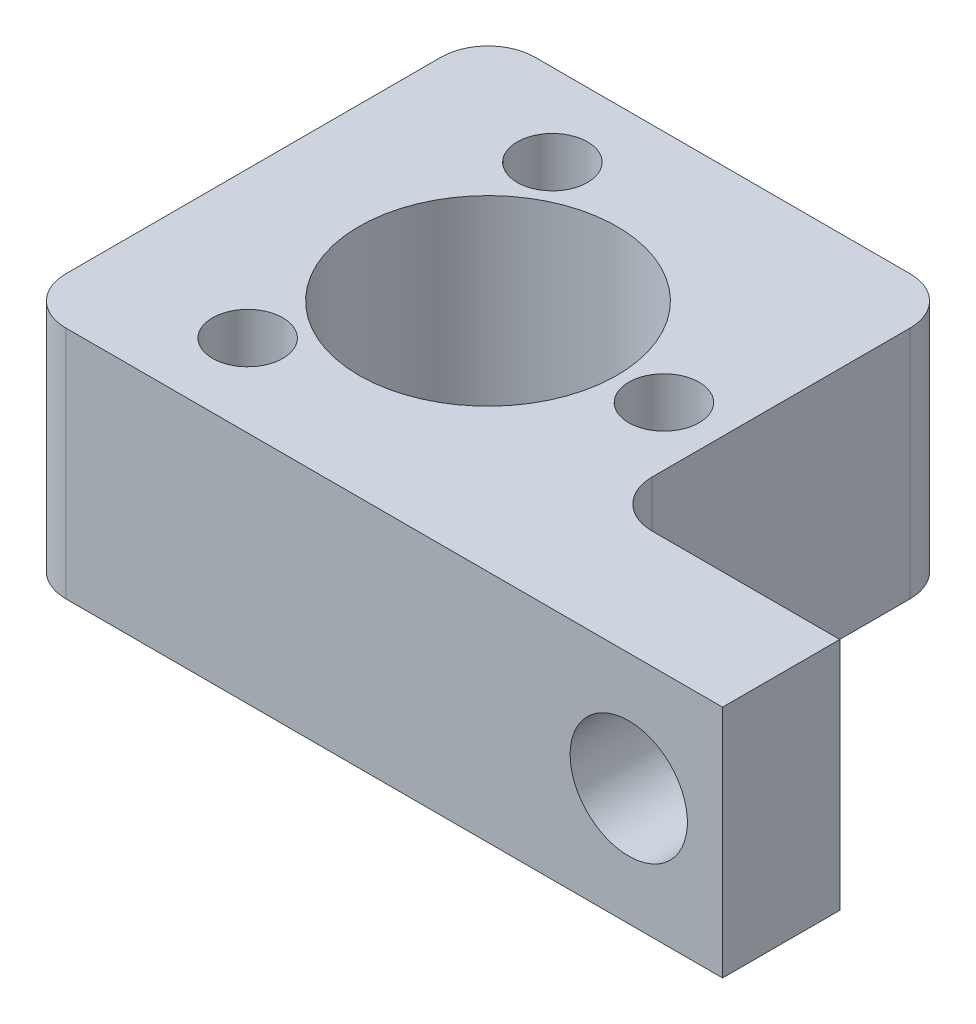
ISO-10303-21;
HEADER;
FILE_DESCRIPTION(('STEP AP214'),'2;1');
FILE_NAME('part.step','',(''),(''),'','','');
FILE_SCHEMA(('AUTOMOTIVE_DESIGN { 1 0 10303 214 1 1 1 1 }'));
ENDSEC;
DATA;
#1=APPLICATION_CONTEXT('core data for automotive mechanical design processes');
#2=APPLICATION_PROTOCOL_DEFINITION('international standard','automotive_design',2000,#1);
#3=PRODUCT_CONTEXT('',#1,'mechanical');
#4=PRODUCT('Part','Part','',(#3));
#5=PRODUCT_RELATED_PRODUCT_CATEGORY('part','',(#4));
#6=PRODUCT_DEFINITION_FORMATION('','',#4);
#7=PRODUCT_DEFINITION_CONTEXT('part definition',#1,'design');
#8=PRODUCT_DEFINITION('design','',#6,#7);
#9=PRODUCT_DEFINITION_SHAPE('','',#8);
#10=(LENGTH_UNIT() NAMED_UNIT(*) SI_UNIT(.MILLI.,.METRE.));
#11=(NAMED_UNIT(*) PLANE_ANGLE_UNIT() SI_UNIT($,.RADIAN.));
#12=(NAMED_UNIT(*) SI_UNIT($,.STERADIAN.) SOLID_ANGLE_UNIT());
#13=UNCERTAINTY_MEASURE_WITH_UNIT(LENGTH_MEASURE(1.E-05),#10,'distance_accuracy_value','');
#14=(GEOMETRIC_REPRESENTATION_CONTEXT(3) GLOBAL_UNCERTAINTY_ASSIGNED_CONTEXT((#13)) GLOBAL_UNIT_ASSIGNED_CONTEXT((#10,
#11,#12)) REPRESENTATION_CONTEXT('',''));
#15=CARTESIAN_POINT('',(0.,0.,0.));
#16=DIRECTION('',(0.,0.,1.));
#17=DIRECTION('',(1.,0.,0.));
#18=AXIS2_PLACEMENT_3D('',#15,#16,#17);
#19=CARTESIAN_POINT('',(12.7,12.7,0.));
#20=DIRECTION('',(1.,0.,0.));
#21=DIRECTION('',(0.,0.,-1.));
#22=AXIS2_PLACEMENT_3D('',#19,#20,#21);
#23=PLANE('',#22);
#24=DIRECTION('',(0.,0.,1.));
#25=VECTOR('',#24,1.);
#26=CARTESIAN_POINT('',(12.7,0.,0.));
#27=LINE('',#26,#25);
#28=CARTESIAN_POINT('',(12.7,0.,-6.35));
#29=VERTEX_POINT('',#28);
#30=CARTESIAN_POINT('',(12.7,0.,0.));
#31=VERTEX_POINT('',#30);
#32=EDGE_CURVE('E234',#29,#31,#27,.T.);
#33=ORIENTED_EDGE('',*,*,#32,.F.);
#34=DIRECTION('',(0.,-1.,0.));
#35=VECTOR('',#34,1.);
#36=CARTESIAN_POINT('',(12.7,12.7,-6.35));
#37=LINE('',#36,#35);
#38=CARTESIAN_POINT('',(12.7,12.7,-6.35));
#39=VERTEX_POINT('',#38);
#40=EDGE_CURVE('E220',#39,#29,#37,.T.);
#41=ORIENTED_EDGE('',*,*,#40,.F.);
#42=DIRECTION('',(0.,0.,1.));
#43=VECTOR('',#42,1.);
#44=CARTESIAN_POINT('',(12.7,12.7,0.));
#45=LINE('',#44,#43);
#46=CARTESIAN_POINT('',(12.7,12.7,0.));
#47=VERTEX_POINT('',#46);
#48=EDGE_CURVE('E228',#39,#47,#45,.T.);
#49=ORIENTED_EDGE('',*,*,#48,.T.);
#50=DIRECTION('',(0.,-1.,0.));
#51=VECTOR('',#50,1.);
#52=CARTESIAN_POINT('',(12.7,12.7,0.));
#53=LINE('',#52,#51);
#54=EDGE_CURVE('E237',#47,#31,#53,.T.);
#55=ORIENTED_EDGE('',*,*,#54,.T.);
#56=EDGE_LOOP('',(#33,#41,#49,#55));
#57=FACE_BOUND('',#56,.T.);
#58=ADVANCED_FACE('F137',(#57),#23,.T.);
#59=CARTESIAN_POINT('',(0.,12.7,-6.35));
#60=DIRECTION('',(0.,0.,-1.));
#61=DIRECTION('',(-1.,0.,0.));
#62=AXIS2_PLACEMENT_3D('',#59,#60,#61);
#63=PLANE('',#62);
#64=CARTESIAN_POINT('',(7.62,6.35,-6.35));
#65=DIRECTION('',(0.,0.,-1.));
#66=DIRECTION('',(-1.,0.,0.));
#67=AXIS2_PLACEMENT_3D('',#64,#65,#66);
#68=CIRCLE('',#67,3.175);
#69=CARTESIAN_POINT('',(4.445,6.35,-6.35));
#70=VERTEX_POINT('',#69);
#71=EDGE_CURVE('E251',#70,#70,#68,.T.);
#72=ORIENTED_EDGE('',*,*,#71,.F.);
#73=EDGE_LOOP('',(#72));
#74=FACE_BOUND('',#73,.T.);
#75=DIRECTION('',(1.,0.,0.));
#76=VECTOR('',#75,1.);
#77=CARTESIAN_POINT('',(0.,0.,-6.35));
#78=LINE('',#77,#76);
#79=CARTESIAN_POINT('',(2.54,0.,-6.35));
#80=VERTEX_POINT('',#79);
#81=EDGE_CURVE('E248',#80,#29,#78,.T.);
#82=ORIENTED_EDGE('',*,*,#81,.F.);
#83=DIRECTION('',(0.,-1.,0.));
#84=VECTOR('',#83,1.);
#85=CARTESIAN_POINT('',(2.54,12.7,-6.35));
#86=LINE('',#85,#84);
#87=CARTESIAN_POINT('',(2.54,12.7,-6.35));
#88=VERTEX_POINT('',#87);
#89=EDGE_CURVE('E223',#80,#88,#86,.F.);
#90=ORIENTED_EDGE('',*,*,#89,.T.);
#91=DIRECTION('',(1.,0.,0.));
#92=VECTOR('',#91,1.);
#93=CARTESIAN_POINT('',(0.,12.7,-6.35));
#94=LINE('',#93,#92);
#95=EDGE_CURVE('E216',#88,#39,#94,.T.);
#96=ORIENTED_EDGE('',*,*,#95,.T.);
#97=ORIENTED_EDGE('',*,*,#40,.T.);
#98=EDGE_LOOP('',(#82,#90,#96,#97));
#99=FACE_BOUND('',#98,.T.);
#100=ADVANCED_FACE('F219',(#74,#99),#63,.T.);
#101=CARTESIAN_POINT('',(0.,12.7,0.));
#102=DIRECTION('',(0.,0.,-1.));
#103=DIRECTION('',(-1.,0.,0.));
#104=AXIS2_PLACEMENT_3D('',#101,#102,#103);
#105=PLANE('',#104);
#106=CARTESIAN_POINT('',(7.62,6.35,0.));
#107=DIRECTION('',(0.,0.,-1.));
#108=DIRECTION('',(-1.,0.,0.));
#109=AXIS2_PLACEMENT_3D('',#106,#107,#108);
#110=CIRCLE('',#109,3.175);
#111=CARTESIAN_POINT('',(4.445,6.35,0.));
#112=VERTEX_POINT('',#111);
#113=EDGE_CURVE('E272',#112,#112,#110,.T.);
#114=ORIENTED_EDGE('',*,*,#113,.T.);
#115=EDGE_LOOP('',(#114));
#116=FACE_BOUND('',#115,.T.);
#117=DIRECTION('',(1.,0.,0.));
#118=VECTOR('',#117,1.);
#119=CARTESIAN_POINT('',(0.,12.7,0.));
#120=LINE('',#119,#118);
#121=CARTESIAN_POINT('',(-22.86,12.7,0.));
#122=VERTEX_POINT('',#121);
#123=EDGE_CURVE('E227',#122,#47,#120,.T.);
#124=ORIENTED_EDGE('',*,*,#123,.F.);
#125=DIRECTION('',(0.,-1.,0.));
#126=VECTOR('',#125,1.);
#127=CARTESIAN_POINT('',(-22.86,0.,0.));
#128=LINE('',#127,#126);
#129=CARTESIAN_POINT('',(-22.86,0.,0.));
#130=VERTEX_POINT('',#129);
#131=EDGE_CURVE('E324',#122,#130,#128,.T.);
#132=ORIENTED_EDGE('',*,*,#131,.T.);
#133=DIRECTION('',(1.,0.,0.));
#134=VECTOR('',#133,1.);
#135=CARTESIAN_POINT('',(0.,0.,0.));
#136=LINE('',#135,#134);
#137=EDGE_CURVE('E245',#130,#31,#136,.T.);
#138=ORIENTED_EDGE('',*,*,#137,.T.);
#139=ORIENTED_EDGE('',*,*,#54,.F.);
#140=EDGE_LOOP('',(#124,#132,#138,#139));
#141=FACE_BOUND('',#140,.T.);
#142=ADVANCED_FACE('F387',(#116,#141),#105,.F.);
#143=CARTESIAN_POINT('',(0.,12.7,0.));
#144=DIRECTION('',(0.,1.,0.));
#145=DIRECTION('',(0.,0.,1.));
#146=AXIS2_PLACEMENT_3D('',#143,#144,#145);
#147=PLANE('',#146);
#148=DIRECTION('',(0.,0.,-1.));
#149=VECTOR('',#148,1.);
#150=CARTESIAN_POINT('',(-25.4,12.7,0.));
#151=LINE('',#150,#149);
#152=CARTESIAN_POINT('',(-25.4,12.7,-2.54));
#153=VERTEX_POINT('',#152);
#154=CARTESIAN_POINT('',(-25.4,12.7,-22.86));
#155=VERTEX_POINT('',#154);
#156=EDGE_CURVE('E297',#153,#155,#151,.T.);
#157=ORIENTED_EDGE('',*,*,#156,.F.);
#158=CARTESIAN_POINT('',(-22.86,12.7,-2.54));
#159=DIRECTION('',(0.,1.,0.));
#160=DIRECTION('',(0.,0.,1.));
#161=AXIS2_PLACEMENT_3D('',#158,#159,#160);
#162=CIRCLE('',#161,2.54);
#163=EDGE_CURVE('E349',#153,#122,#162,.T.);
#164=ORIENTED_EDGE('',*,*,#163,.T.);
#165=ORIENTED_EDGE('',*,*,#123,.T.);
#166=ORIENTED_EDGE('',*,*,#48,.F.);
#167=ORIENTED_EDGE('',*,*,#95,.F.);
#168=CARTESIAN_POINT('',(2.54,12.7,-8.89));
#169=DIRECTION('',(0.,1.,0.));
#170=DIRECTION('',(0.,0.,1.));
#171=AXIS2_PLACEMENT_3D('',#168,#169,#170);
#172=CIRCLE('',#171,2.54);
#173=CARTESIAN_POINT('',(0.,12.7,-8.89));
#174=VERTEX_POINT('',#173);
#175=EDGE_CURVE('E12',#88,#174,#172,.F.);
#176=ORIENTED_EDGE('',*,*,#175,.T.);
#177=DIRECTION('',(0.,0.,-1.));
#178=VECTOR('',#177,1.);
#179=CARTESIAN_POINT('',(0.,12.7,0.));
#180=LINE('',#179,#178);
#181=CARTESIAN_POINT('',(0.,12.7,-22.86));
#182=VERTEX_POINT('',#181);
#183=EDGE_CURVE('E258',#174,#182,#180,.T.);
#184=ORIENTED_EDGE('',*,*,#183,.T.);
#185=CARTESIAN_POINT('',(-2.54,12.7,-22.86));
#186=DIRECTION('',(0.,1.,0.));
#187=DIRECTION('',(0.,0.,1.));
#188=AXIS2_PLACEMENT_3D('',#185,#186,#187);
#189=CIRCLE('',#188,2.54);
#190=CARTESIAN_POINT('',(-2.54,12.7,-25.4));
#191=VERTEX_POINT('',#190);
#192=EDGE_CURVE('E160',#182,#191,#189,.T.);
#193=ORIENTED_EDGE('',*,*,#192,.T.);
#194=DIRECTION('',(-1.,0.,0.));
#195=VECTOR('',#194,1.);
#196=CARTESIAN_POINT('',(0.,12.7,-25.4));
#197=LINE('',#196,#195);
#198=CARTESIAN_POINT('',(-22.86,12.7,-25.4));
#199=VERTEX_POINT('',#198);
#200=EDGE_CURVE('E301',#191,#199,#197,.T.);
#201=ORIENTED_EDGE('',*,*,#200,.T.);
#202=CARTESIAN_POINT('',(-22.86,12.7,-22.86));
#203=DIRECTION('',(0.,1.,0.));
#204=DIRECTION('',(0.,0.,1.));
#205=AXIS2_PLACEMENT_3D('',#202,#203,#204);
#206=CIRCLE('',#205,2.54);
#207=EDGE_CURVE('E346',#199,#155,#206,.T.);
#208=ORIENTED_EDGE('',*,*,#207,.T.);
#209=EDGE_LOOP('',(#157,#164,#165,#166,#167,#176,#184,#193,#201,#208));
#210=FACE_BOUND('',#209,.T.);
#211=CARTESIAN_POINT('',(-12.7,12.7,-12.7));
#212=DIRECTION('',(0.,1.,0.));
#213=DIRECTION('',(0.,0.,1.));
#214=AXIS2_PLACEMENT_3D('',#211,#212,#213);
#215=CIRCLE('',#214,6.985);
#216=CARTESIAN_POINT('',(-12.7,12.7,-5.715));
#217=VERTEX_POINT('',#216);
#218=EDGE_CURVE('E289',#217,#217,#215,.T.);
#219=ORIENTED_EDGE('',*,*,#218,.F.);
#220=EDGE_LOOP('',(#219));
#221=FACE_BOUND('',#220,.T.);
#222=CARTESIAN_POINT('',(-3.175,12.7,-12.7));
#223=DIRECTION('',(0.,1.,0.));
#224=DIRECTION('',(0.,0.,1.));
#225=AXIS2_PLACEMENT_3D('',#222,#223,#224);
#226=CIRCLE('',#225,1.905);
#227=CARTESIAN_POINT('',(-3.175,12.7,-10.795));
#228=VERTEX_POINT('',#227);
#229=EDGE_CURVE('E281',#228,#228,#226,.T.);
#230=ORIENTED_EDGE('',*,*,#229,.F.);
#231=EDGE_LOOP('',(#230));
#232=FACE_BOUND('',#231,.T.);
#233=CARTESIAN_POINT('',(-17.4624999999999,12.7,-4.45110802895317));
#234=DIRECTION('',(0.,1.,0.));
#235=DIRECTION('',(0.,0.,1.));
#236=AXIS2_PLACEMENT_3D('',#233,#234,#235);
#237=CIRCLE('',#236,1.905);
#238=CARTESIAN_POINT('',(-17.4624999999999,12.7,-2.54610802895317));
#239=VERTEX_POINT('',#238);
#240=EDGE_CURVE('E273',#239,#239,#237,.T.);
#241=ORIENTED_EDGE('',*,*,#240,.F.);
#242=EDGE_LOOP('',(#241));
#243=FACE_BOUND('',#242,.T.);
#244=CARTESIAN_POINT('',(-17.4625,12.7,-20.9488919710468));
#245=DIRECTION('',(0.,1.,0.));
#246=DIRECTION('',(0.,0.,1.));
#247=AXIS2_PLACEMENT_3D('',#244,#245,#246);
#248=CIRCLE('',#247,1.905);
#249=CARTESIAN_POINT('',(-17.4625,12.7,-19.0438919710468));
#250=VERTEX_POINT('',#249);
#251=EDGE_CURVE('E263',#250,#250,#248,.T.);
#252=ORIENTED_EDGE('',*,*,#251,.F.);
#253=EDGE_LOOP('',(#252));
#254=FACE_BOUND('',#253,.T.);
#255=ADVANCED_FACE('F240',(#210,#221,#232,#243,#254),#147,.T.);
#256=CARTESIAN_POINT('',(0.,0.,0.));
#257=DIRECTION('',(0.,1.,0.));
#258=DIRECTION('',(0.,0.,1.));
#259=AXIS2_PLACEMENT_3D('',#256,#257,#258);
#260=PLANE('',#259);
#261=ORIENTED_EDGE('',*,*,#137,.F.);
#262=CARTESIAN_POINT('',(-22.86,0.,-2.54));
#263=DIRECTION('',(0.,1.,0.));
#264=DIRECTION('',(0.,0.,1.));
#265=AXIS2_PLACEMENT_3D('',#262,#263,#264);
#266=CIRCLE('',#265,2.54);
#267=CARTESIAN_POINT('',(-25.4,0.,-2.54));
#268=VERTEX_POINT('',#267);
#269=EDGE_CURVE('E334',#130,#268,#266,.F.);
#270=ORIENTED_EDGE('',*,*,#269,.T.);
#271=DIRECTION('',(0.,0.,-1.));
#272=VECTOR('',#271,1.);
#273=CARTESIAN_POINT('',(-25.4,0.,0.));
#274=LINE('',#273,#272);
#275=CARTESIAN_POINT('',(-25.4,0.,-22.86));
#276=VERTEX_POINT('',#275);
#277=EDGE_CURVE('E293',#268,#276,#274,.T.);
#278=ORIENTED_EDGE('',*,*,#277,.T.);
#279=CARTESIAN_POINT('',(-22.86,0.,-22.86));
#280=DIRECTION('',(0.,1.,0.));
#281=DIRECTION('',(0.,0.,1.));
#282=AXIS2_PLACEMENT_3D('',#279,#280,#281);
#283=CIRCLE('',#282,2.54);
#284=CARTESIAN_POINT('',(-22.86,0.,-25.4));
#285=VERTEX_POINT('',#284);
#286=EDGE_CURVE('E331',#276,#285,#283,.F.);
#287=ORIENTED_EDGE('',*,*,#286,.T.);
#288=DIRECTION('',(-1.,0.,0.));
#289=VECTOR('',#288,1.);
#290=CARTESIAN_POINT('',(0.,0.,-25.4));
#291=LINE('',#290,#289);
#292=CARTESIAN_POINT('',(-2.54,0.,-25.4));
#293=VERTEX_POINT('',#292);
#294=EDGE_CURVE('E310',#293,#285,#291,.T.);
#295=ORIENTED_EDGE('',*,*,#294,.F.);
#296=CARTESIAN_POINT('',(-2.54,0.,-22.86));
#297=DIRECTION('',(0.,1.,0.));
#298=DIRECTION('',(0.,0.,1.));
#299=AXIS2_PLACEMENT_3D('',#296,#297,#298);
#300=CIRCLE('',#299,2.54);
#301=CARTESIAN_POINT('',(0.,0.,-22.86));
#302=VERTEX_POINT('',#301);
#303=EDGE_CURVE('E328',#293,#302,#300,.F.);
#304=ORIENTED_EDGE('',*,*,#303,.T.);
#305=DIRECTION('',(0.,0.,-1.));
#306=VECTOR('',#305,1.);
#307=CARTESIAN_POINT('',(0.,0.,0.));
#308=LINE('',#307,#306);
#309=CARTESIAN_POINT('',(0.,0.,-8.89));
#310=VERTEX_POINT('',#309);
#311=EDGE_CURVE('E302',#310,#302,#308,.T.);
#312=ORIENTED_EDGE('',*,*,#311,.F.);
#313=CARTESIAN_POINT('',(2.54,0.,-8.89));
#314=DIRECTION('',(0.,1.,0.));
#315=DIRECTION('',(0.,0.,1.));
#316=AXIS2_PLACEMENT_3D('',#313,#314,#315);
#317=CIRCLE('',#316,2.54);
#318=EDGE_CURVE('E146',#310,#80,#317,.T.);
#319=ORIENTED_EDGE('',*,*,#318,.T.);
#320=ORIENTED_EDGE('',*,*,#81,.T.);
#321=ORIENTED_EDGE('',*,*,#32,.T.);
#322=EDGE_LOOP('',(#261,#270,#278,#287,#295,#304,#312,#319,#320,#321));
#323=FACE_BOUND('',#322,.T.);
#324=CARTESIAN_POINT('',(-17.4624999999999,0.,-4.45110802895317));
#325=DIRECTION('',(0.,1.,0.));
#326=DIRECTION('',(0.,0.,1.));
#327=AXIS2_PLACEMENT_3D('',#324,#325,#326);
#328=CIRCLE('',#327,1.905);
#329=CARTESIAN_POINT('',(-17.4624999999999,0.,-2.54610802895317));
#330=VERTEX_POINT('',#329);
#331=EDGE_CURVE('E267',#330,#330,#328,.T.);
#332=ORIENTED_EDGE('',*,*,#331,.T.);
#333=EDGE_LOOP('',(#332));
#334=FACE_BOUND('',#333,.T.);
#335=CARTESIAN_POINT('',(-12.7,0.,-12.7));
#336=DIRECTION('',(0.,1.,0.));
#337=DIRECTION('',(0.,0.,1.));
#338=AXIS2_PLACEMENT_3D('',#335,#336,#337);
#339=CIRCLE('',#338,6.985);
#340=CARTESIAN_POINT('',(-12.7,0.,-5.715));
#341=VERTEX_POINT('',#340);
#342=EDGE_CURVE('E285',#341,#341,#339,.T.);
#343=ORIENTED_EDGE('',*,*,#342,.T.);
#344=EDGE_LOOP('',(#343));
#345=FACE_BOUND('',#344,.T.);
#346=CARTESIAN_POINT('',(-3.175,0.,-12.7));
#347=DIRECTION('',(0.,1.,0.));
#348=DIRECTION('',(0.,0.,1.));
#349=AXIS2_PLACEMENT_3D('',#346,#347,#348);
#350=CIRCLE('',#349,1.905);
#351=CARTESIAN_POINT('',(-3.175,0.,-10.795));
#352=VERTEX_POINT('',#351);
#353=EDGE_CURVE('E277',#352,#352,#350,.T.);
#354=ORIENTED_EDGE('',*,*,#353,.T.);
#355=EDGE_LOOP('',(#354));
#356=FACE_BOUND('',#355,.T.);
#357=CARTESIAN_POINT('',(-17.4625,0.,-20.9488919710468));
#358=DIRECTION('',(0.,1.,0.));
#359=DIRECTION('',(0.,0.,1.));
#360=AXIS2_PLACEMENT_3D('',#357,#358,#359);
#361=CIRCLE('',#360,1.905);
#362=CARTESIAN_POINT('',(-17.4625,0.,-19.0438919710468));
#363=VERTEX_POINT('',#362);
#364=EDGE_CURVE('E268',#363,#363,#361,.T.);
#365=ORIENTED_EDGE('',*,*,#364,.T.);
#366=EDGE_LOOP('',(#365));
#367=FACE_BOUND('',#366,.T.);
#368=ADVANCED_FACE('F361',(#323,#334,#345,#356,#367),#260,.F.);
#369=CARTESIAN_POINT('',(-17.4625,12.7,-20.9488919710468));
#370=DIRECTION('',(0.,-1.,0.));
#371=DIRECTION('',(0.,0.,-1.));
#372=AXIS2_PLACEMENT_3D('',#369,#370,#371);
#373=CYLINDRICAL_SURFACE('',#372,1.905);
#374=ORIENTED_EDGE('',*,*,#251,.T.);
#375=EDGE_LOOP('',(#374));
#376=FACE_BOUND('',#375,.T.);
#377=ORIENTED_EDGE('',*,*,#364,.F.);
#378=EDGE_LOOP('',(#377));
#379=FACE_BOUND('',#378,.T.);
#380=ADVANCED_FACE('F430',(#376,#379),#373,.F.);
#381=CARTESIAN_POINT('',(-17.4624999999999,12.7,-4.45110802895317));
#382=DIRECTION('',(0.,-1.,0.));
#383=DIRECTION('',(0.,0.,-1.));
#384=AXIS2_PLACEMENT_3D('',#381,#382,#383);
#385=CYLINDRICAL_SURFACE('',#384,1.905);
#386=ORIENTED_EDGE('',*,*,#240,.T.);
#387=EDGE_LOOP('',(#386));
#388=FACE_BOUND('',#387,.T.);
#389=ORIENTED_EDGE('',*,*,#331,.F.);
#390=EDGE_LOOP('',(#389));
#391=FACE_BOUND('',#390,.T.);
#392=ADVANCED_FACE('F434',(#388,#391),#385,.F.);
#393=CARTESIAN_POINT('',(-3.175,12.7,-12.7));
#394=DIRECTION('',(0.,-1.,0.));
#395=DIRECTION('',(0.,0.,-1.));
#396=AXIS2_PLACEMENT_3D('',#393,#394,#395);
#397=CYLINDRICAL_SURFACE('',#396,1.905);
#398=ORIENTED_EDGE('',*,*,#229,.T.);
#399=EDGE_LOOP('',(#398));
#400=FACE_BOUND('',#399,.T.);
#401=ORIENTED_EDGE('',*,*,#353,.F.);
#402=EDGE_LOOP('',(#401));
#403=FACE_BOUND('',#402,.T.);
#404=ADVANCED_FACE('F440',(#400,#403),#397,.F.);
#405=CARTESIAN_POINT('',(-12.7,12.7,-12.7));
#406=DIRECTION('',(0.,-1.,0.));
#407=DIRECTION('',(0.,0.,-1.));
#408=AXIS2_PLACEMENT_3D('',#405,#406,#407);
#409=CYLINDRICAL_SURFACE('',#408,6.985);
#410=ORIENTED_EDGE('',*,*,#218,.T.);
#411=EDGE_LOOP('',(#410));
#412=FACE_BOUND('',#411,.T.);
#413=ORIENTED_EDGE('',*,*,#342,.F.);
#414=EDGE_LOOP('',(#413));
#415=FACE_BOUND('',#414,.T.);
#416=ADVANCED_FACE('F409',(#412,#415),#409,.F.);
#417=CARTESIAN_POINT('',(-25.4,12.7,0.));
#418=DIRECTION('',(-1.,0.,0.));
#419=DIRECTION('',(0.,0.,1.));
#420=AXIS2_PLACEMENT_3D('',#417,#418,#419);
#421=PLANE('',#420);
#422=ORIENTED_EDGE('',*,*,#277,.F.);
#423=DIRECTION('',(0.,-1.,0.));
#424=VECTOR('',#423,1.);
#425=CARTESIAN_POINT('',(-25.4,12.7,-2.54));
#426=LINE('',#425,#424);
#427=EDGE_CURVE('E341',#268,#153,#426,.F.);
#428=ORIENTED_EDGE('',*,*,#427,.T.);
#429=ORIENTED_EDGE('',*,*,#156,.T.);
#430=DIRECTION('',(0.,-1.,0.));
#431=VECTOR('',#430,1.);
#432=CARTESIAN_POINT('',(-25.4,0.,-22.86));
#433=LINE('',#432,#431);
#434=EDGE_CURVE('E337',#155,#276,#433,.T.);
#435=ORIENTED_EDGE('',*,*,#434,.T.);
#436=EDGE_LOOP('',(#422,#428,#429,#435));
#437=FACE_BOUND('',#436,.T.);
#438=ADVANCED_FACE('F380',(#437),#421,.T.);
#439=CARTESIAN_POINT('',(0.,12.7,-25.4));
#440=DIRECTION('',(0.,0.,1.));
#441=DIRECTION('',(1.,0.,0.));
#442=AXIS2_PLACEMENT_3D('',#439,#440,#441);
#443=PLANE('',#442);
#444=ORIENTED_EDGE('',*,*,#294,.T.);
#445=DIRECTION('',(0.,-1.,0.));
#446=VECTOR('',#445,1.);
#447=CARTESIAN_POINT('',(-22.86,12.7,-25.4));
#448=LINE('',#447,#446);
#449=EDGE_CURVE('E153',#285,#199,#448,.F.);
#450=ORIENTED_EDGE('',*,*,#449,.T.);
#451=ORIENTED_EDGE('',*,*,#200,.F.);
#452=DIRECTION('',(0.,-1.,0.));
#453=VECTOR('',#452,1.);
#454=CARTESIAN_POINT('',(-2.54,12.7,-25.4));
#455=LINE('',#454,#453);
#456=EDGE_CURVE('E352',#191,#293,#455,.T.);
#457=ORIENTED_EDGE('',*,*,#456,.T.);
#458=EDGE_LOOP('',(#444,#450,#451,#457));
#459=FACE_BOUND('',#458,.T.);
#460=ADVANCED_FACE('F373',(#459),#443,.F.);
#461=CARTESIAN_POINT('',(0.,12.7,0.));
#462=DIRECTION('',(-1.,0.,0.));
#463=DIRECTION('',(0.,0.,1.));
#464=AXIS2_PLACEMENT_3D('',#461,#462,#463);
#465=PLANE('',#464);
#466=ORIENTED_EDGE('',*,*,#183,.F.);
#467=DIRECTION('',(0.,-1.,0.));
#468=VECTOR('',#467,1.);
#469=CARTESIAN_POINT('',(0.,12.7,-8.89));
#470=LINE('',#469,#468);
#471=EDGE_CURVE('E318',#174,#310,#470,.T.);
#472=ORIENTED_EDGE('',*,*,#471,.T.);
#473=ORIENTED_EDGE('',*,*,#311,.T.);
#474=DIRECTION('',(0.,-1.,0.));
#475=VECTOR('',#474,1.);
#476=CARTESIAN_POINT('',(0.,12.7,-22.86));
#477=LINE('',#476,#475);
#478=EDGE_CURVE('E236',#302,#182,#477,.F.);
#479=ORIENTED_EDGE('',*,*,#478,.T.);
#480=EDGE_LOOP('',(#466,#472,#473,#479));
#481=FACE_BOUND('',#480,.T.);
#482=ADVANCED_FACE('F368',(#481),#465,.F.);
#483=CARTESIAN_POINT('',(2.54,12.7,-8.89));
#484=DIRECTION('',(0.,-1.,0.));
#485=DIRECTION('',(0.,0.,-1.));
#486=AXIS2_PLACEMENT_3D('',#483,#484,#485);
#487=CYLINDRICAL_SURFACE('',#486,2.54);
#488=ORIENTED_EDGE('',*,*,#175,.F.);
#489=ORIENTED_EDGE('',*,*,#89,.F.);
#490=ORIENTED_EDGE('',*,*,#318,.F.);
#491=ORIENTED_EDGE('',*,*,#471,.F.);
#492=EDGE_LOOP('',(#488,#489,#490,#491));
#493=FACE_BOUND('',#492,.T.);
#494=ADVANCED_FACE('F365',(#493),#487,.F.);
#495=CARTESIAN_POINT('',(-22.86,12.7,-2.54));
#496=DIRECTION('',(0.,1.,0.));
#497=DIRECTION('',(0.,0.,1.));
#498=AXIS2_PLACEMENT_3D('',#495,#496,#497);
#499=CYLINDRICAL_SURFACE('',#498,2.54);
#500=ORIENTED_EDGE('',*,*,#163,.F.);
#501=ORIENTED_EDGE('',*,*,#427,.F.);
#502=ORIENTED_EDGE('',*,*,#269,.F.);
#503=ORIENTED_EDGE('',*,*,#131,.F.);
#504=EDGE_LOOP('',(#500,#501,#502,#503));
#505=FACE_BOUND('',#504,.T.);
#506=ADVANCED_FACE('F385',(#505),#499,.T.);
#507=CARTESIAN_POINT('',(-22.86,12.7,-22.86));
#508=DIRECTION('',(0.,1.,0.));
#509=DIRECTION('',(0.,0.,1.));
#510=AXIS2_PLACEMENT_3D('',#507,#508,#509);
#511=CYLINDRICAL_SURFACE('',#510,2.54);
#512=ORIENTED_EDGE('',*,*,#207,.F.);
#513=ORIENTED_EDGE('',*,*,#449,.F.);
#514=ORIENTED_EDGE('',*,*,#286,.F.);
#515=ORIENTED_EDGE('',*,*,#434,.F.);
#516=EDGE_LOOP('',(#512,#513,#514,#515));
#517=FACE_BOUND('',#516,.T.);
#518=ADVANCED_FACE('F378',(#517),#511,.T.);
#519=CARTESIAN_POINT('',(-2.54,12.7,-22.86));
#520=DIRECTION('',(0.,-1.,0.));
#521=DIRECTION('',(0.,0.,-1.));
#522=AXIS2_PLACEMENT_3D('',#519,#520,#521);
#523=CYLINDRICAL_SURFACE('',#522,2.54);
#524=ORIENTED_EDGE('',*,*,#192,.F.);
#525=ORIENTED_EDGE('',*,*,#478,.F.);
#526=ORIENTED_EDGE('',*,*,#303,.F.);
#527=ORIENTED_EDGE('',*,*,#456,.F.);
#528=EDGE_LOOP('',(#524,#525,#526,#527));
#529=FACE_BOUND('',#528,.T.);
#530=ADVANCED_FACE('F139',(#529),#523,.T.);
#531=CARTESIAN_POINT('',(7.62,6.35,0.));
#532=DIRECTION('',(0.,0.,-1.));
#533=DIRECTION('',(-1.,0.,0.));
#534=AXIS2_PLACEMENT_3D('',#531,#532,#533);
#535=CYLINDRICAL_SURFACE('',#534,3.175);
#536=ORIENTED_EDGE('',*,*,#113,.F.);
#537=EDGE_LOOP('',(#536));
#538=FACE_BOUND('',#537,.T.);
#539=ORIENTED_EDGE('',*,*,#71,.T.);
#540=EDGE_LOOP('',(#539));
#541=FACE_BOUND('',#540,.T.);
#542=ADVANCED_FACE('F419',(#538,#541),#535,.F.);
#543=CLOSED_SHELL('',(#58,#100,#142,#255,#368,#380,#392,#404,#416,#438,#460,#482,#494,#506,#518,
#530,#542));
#544=MANIFOLD_SOLID_BREP('B2',#543);
#545=ADVANCED_BREP_SHAPE_REPRESENTATION('',(#18,#544),#14);
#546=SHAPE_DEFINITION_REPRESENTATION(#9,#545);
ENDSEC;
END-ISO-10303-21;
